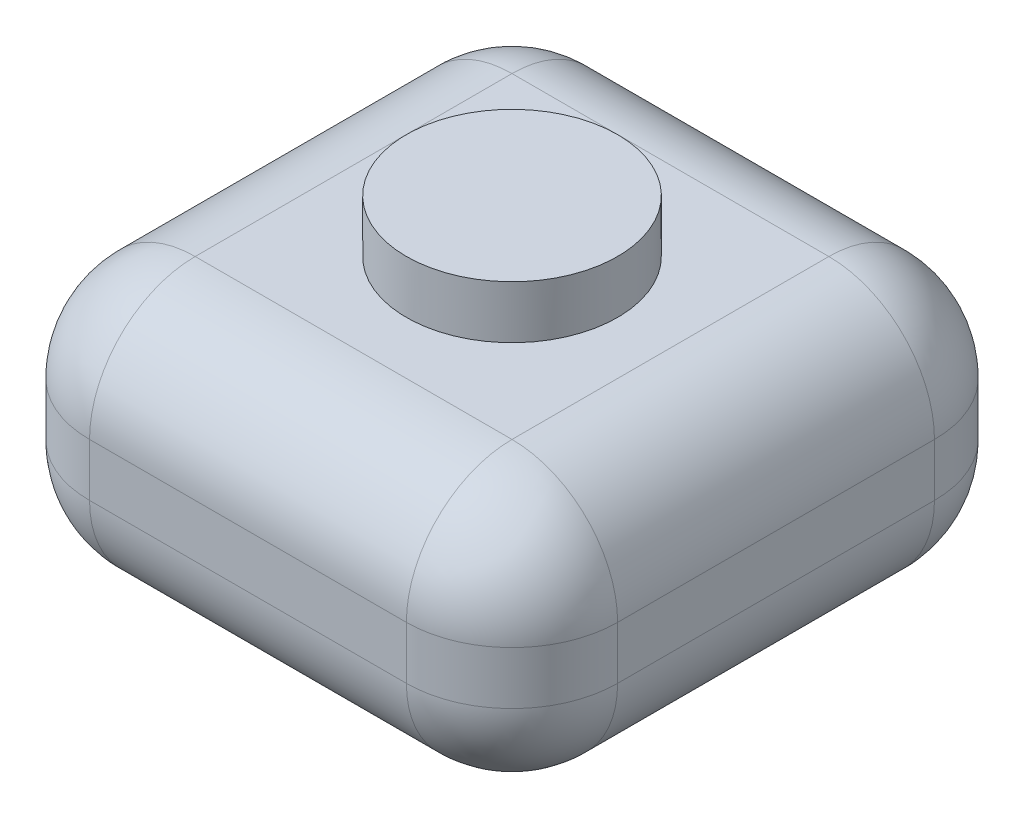
ISO-10303-21;
HEADER;
FILE_DESCRIPTION(('STEP AP214'),'2;1');
FILE_NAME('part.step','',(''),(''),'','','');
FILE_SCHEMA(('AUTOMOTIVE_DESIGN { 1 0 10303 214 1 1 1 1 }'));
ENDSEC;
DATA;
#1=APPLICATION_CONTEXT('core data for automotive mechanical design processes');
#2=APPLICATION_PROTOCOL_DEFINITION('international standard','automotive_design',2000,#1);
#3=PRODUCT_CONTEXT('',#1,'mechanical');
#4=PRODUCT('Part','Part','',(#3));
#5=PRODUCT_RELATED_PRODUCT_CATEGORY('part','',(#4));
#6=PRODUCT_DEFINITION_FORMATION('','',#4);
#7=PRODUCT_DEFINITION_CONTEXT('part definition',#1,'design');
#8=PRODUCT_DEFINITION('design','',#6,#7);
#9=PRODUCT_DEFINITION_SHAPE('','',#8);
#10=(LENGTH_UNIT() NAMED_UNIT(*) SI_UNIT(.MILLI.,.METRE.));
#11=(NAMED_UNIT(*) PLANE_ANGLE_UNIT() SI_UNIT($,.RADIAN.));
#12=(NAMED_UNIT(*) SI_UNIT($,.STERADIAN.) SOLID_ANGLE_UNIT());
#13=UNCERTAINTY_MEASURE_WITH_UNIT(LENGTH_MEASURE(1.E-05),#10,'distance_accuracy_value','');
#14=(GEOMETRIC_REPRESENTATION_CONTEXT(3) GLOBAL_UNCERTAINTY_ASSIGNED_CONTEXT((#13)) GLOBAL_UNIT_ASSIGNED_CONTEXT((#10,
#11,#12)) REPRESENTATION_CONTEXT('',''));
#15=CARTESIAN_POINT('',(0.,0.,0.));
#16=DIRECTION('',(0.,0.,1.));
#17=DIRECTION('',(1.,0.,0.));
#18=AXIS2_PLACEMENT_3D('',#15,#16,#17);
#19=CARTESIAN_POINT('',(-5.,5.,5.));
#20=DIRECTION('',(-1.,0.,0.));
#21=DIRECTION('',(0.,0.,1.));
#22=AXIS2_PLACEMENT_3D('',#19,#20,#21);
#23=PLANE('',#22);
#24=DIRECTION('',(0.,0.,-1.));
#25=VECTOR('',#24,1.);
#26=CARTESIAN_POINT('',(-5.,3.,-5.));
#27=LINE('',#26,#25);
#28=CARTESIAN_POINT('',(-5.,3.,3.));
#29=VERTEX_POINT('',#28);
#30=CARTESIAN_POINT('',(-5.,3.,-3.));
#31=VERTEX_POINT('',#30);
#32=EDGE_CURVE('E200',#29,#31,#27,.T.);
#33=ORIENTED_EDGE('',*,*,#32,.T.);
#34=DIRECTION('',(0.,-1.,0.));
#35=VECTOR('',#34,1.);
#36=CARTESIAN_POINT('',(-5.,5.,-3.));
#37=LINE('',#36,#35);
#38=CARTESIAN_POINT('',(-5.,2.,-3.));
#39=VERTEX_POINT('',#38);
#40=EDGE_CURVE('E202',#31,#39,#37,.T.);
#41=ORIENTED_EDGE('',*,*,#40,.T.);
#42=DIRECTION('',(0.,0.,-1.));
#43=VECTOR('',#42,1.);
#44=CARTESIAN_POINT('',(-5.,2.,5.));
#45=LINE('',#44,#43);
#46=CARTESIAN_POINT('',(-5.,2.,3.));
#47=VERTEX_POINT('',#46);
#48=EDGE_CURVE('E198',#39,#47,#45,.F.);
#49=ORIENTED_EDGE('',*,*,#48,.T.);
#50=DIRECTION('',(0.,-1.,0.));
#51=VECTOR('',#50,1.);
#52=CARTESIAN_POINT('',(-5.,5.,3.));
#53=LINE('',#52,#51);
#54=EDGE_CURVE('E196',#47,#29,#53,.F.);
#55=ORIENTED_EDGE('',*,*,#54,.T.);
#56=EDGE_LOOP('',(#33,#41,#49,#55));
#57=FACE_BOUND('',#56,.T.);
#58=ADVANCED_FACE('F36',(#57),#23,.T.);
#59=CARTESIAN_POINT('',(-5.,5.,5.));
#60=DIRECTION('',(0.,0.,-1.));
#61=DIRECTION('',(-1.,0.,0.));
#62=AXIS2_PLACEMENT_3D('',#59,#60,#61);
#63=PLANE('',#62);
#64=DIRECTION('',(1.,0.,0.));
#65=VECTOR('',#64,1.);
#66=CARTESIAN_POINT('',(-5.,3.,5.));
#67=LINE('',#66,#65);
#68=CARTESIAN_POINT('',(3.,3.,5.));
#69=VERTEX_POINT('',#68);
#70=CARTESIAN_POINT('',(-3.,3.,5.));
#71=VERTEX_POINT('',#70);
#72=EDGE_CURVE('E51',#69,#71,#67,.F.);
#73=ORIENTED_EDGE('',*,*,#72,.T.);
#74=DIRECTION('',(0.,-1.,0.));
#75=VECTOR('',#74,1.);
#76=CARTESIAN_POINT('',(-3.,0.,5.));
#77=LINE('',#76,#75);
#78=CARTESIAN_POINT('',(-3.,2.,5.));
#79=VERTEX_POINT('',#78);
#80=EDGE_CURVE('E44',#71,#79,#77,.T.);
#81=ORIENTED_EDGE('',*,*,#80,.T.);
#82=DIRECTION('',(1.,0.,0.));
#83=VECTOR('',#82,1.);
#84=CARTESIAN_POINT('',(5.,2.,5.));
#85=LINE('',#84,#83);
#86=CARTESIAN_POINT('',(3.,2.,5.));
#87=VERTEX_POINT('',#86);
#88=EDGE_CURVE('E205',#79,#87,#85,.T.);
#89=ORIENTED_EDGE('',*,*,#88,.T.);
#90=DIRECTION('',(0.,-1.,0.));
#91=VECTOR('',#90,1.);
#92=CARTESIAN_POINT('',(3.,5.,5.));
#93=LINE('',#92,#91);
#94=EDGE_CURVE('E56',#87,#69,#93,.F.);
#95=ORIENTED_EDGE('',*,*,#94,.T.);
#96=EDGE_LOOP('',(#73,#81,#89,#95));
#97=FACE_BOUND('',#96,.T.);
#98=ADVANCED_FACE('F298',(#97),#63,.F.);
#99=CARTESIAN_POINT('',(5.,5.,5.));
#100=DIRECTION('',(-1.,0.,0.));
#101=DIRECTION('',(0.,0.,1.));
#102=AXIS2_PLACEMENT_3D('',#99,#100,#101);
#103=PLANE('',#102);
#104=DIRECTION('',(0.,-1.,0.));
#105=VECTOR('',#104,1.);
#106=CARTESIAN_POINT('',(5.,5.,-3.));
#107=LINE('',#106,#105);
#108=CARTESIAN_POINT('',(5.,2.,-3.));
#109=VERTEX_POINT('',#108);
#110=CARTESIAN_POINT('',(5.,3.,-3.));
#111=VERTEX_POINT('',#110);
#112=EDGE_CURVE('E191',#109,#111,#107,.F.);
#113=ORIENTED_EDGE('',*,*,#112,.T.);
#114=DIRECTION('',(0.,0.,-1.));
#115=VECTOR('',#114,1.);
#116=CARTESIAN_POINT('',(5.,3.,5.));
#117=LINE('',#116,#115);
#118=CARTESIAN_POINT('',(5.,3.,3.));
#119=VERTEX_POINT('',#118);
#120=EDGE_CURVE('E193',#111,#119,#117,.F.);
#121=ORIENTED_EDGE('',*,*,#120,.T.);
#122=DIRECTION('',(0.,-1.,0.));
#123=VECTOR('',#122,1.);
#124=CARTESIAN_POINT('',(5.,5.,3.));
#125=LINE('',#124,#123);
#126=CARTESIAN_POINT('',(5.,2.,3.));
#127=VERTEX_POINT('',#126);
#128=EDGE_CURVE('E187',#119,#127,#125,.T.);
#129=ORIENTED_EDGE('',*,*,#128,.T.);
#130=DIRECTION('',(0.,0.,-1.));
#131=VECTOR('',#130,1.);
#132=CARTESIAN_POINT('',(5.,2.,-5.));
#133=LINE('',#132,#131);
#134=EDGE_CURVE('E189',#127,#109,#133,.T.);
#135=ORIENTED_EDGE('',*,*,#134,.T.);
#136=EDGE_LOOP('',(#113,#121,#129,#135));
#137=FACE_BOUND('',#136,.T.);
#138=ADVANCED_FACE('F273',(#137),#103,.F.);
#139=CARTESIAN_POINT('',(-5.,5.,-5.));
#140=DIRECTION('',(0.,0.,-1.));
#141=DIRECTION('',(-1.,0.,0.));
#142=AXIS2_PLACEMENT_3D('',#139,#140,#141);
#143=PLANE('',#142);
#144=DIRECTION('',(1.,0.,0.));
#145=VECTOR('',#144,1.);
#146=CARTESIAN_POINT('',(5.,3.,-5.));
#147=LINE('',#146,#145);
#148=CARTESIAN_POINT('',(-3.,3.,-5.));
#149=VERTEX_POINT('',#148);
#150=CARTESIAN_POINT('',(3.,3.,-5.));
#151=VERTEX_POINT('',#150);
#152=EDGE_CURVE('E135',#149,#151,#147,.T.);
#153=ORIENTED_EDGE('',*,*,#152,.T.);
#154=DIRECTION('',(0.,-1.,0.));
#155=VECTOR('',#154,1.);
#156=CARTESIAN_POINT('',(3.,0.,-5.));
#157=LINE('',#156,#155);
#158=CARTESIAN_POINT('',(3.,2.,-5.));
#159=VERTEX_POINT('',#158);
#160=EDGE_CURVE('E131',#151,#159,#157,.T.);
#161=ORIENTED_EDGE('',*,*,#160,.T.);
#162=DIRECTION('',(1.,0.,0.));
#163=VECTOR('',#162,1.);
#164=CARTESIAN_POINT('',(-5.,2.,-5.));
#165=LINE('',#164,#163);
#166=CARTESIAN_POINT('',(-3.,2.,-5.));
#167=VERTEX_POINT('',#166);
#168=EDGE_CURVE('E123',#159,#167,#165,.F.);
#169=ORIENTED_EDGE('',*,*,#168,.T.);
#170=DIRECTION('',(0.,-1.,0.));
#171=VECTOR('',#170,1.);
#172=CARTESIAN_POINT('',(-3.,5.,-5.));
#173=LINE('',#172,#171);
#174=EDGE_CURVE('E128',#167,#149,#173,.F.);
#175=ORIENTED_EDGE('',*,*,#174,.T.);
#176=EDGE_LOOP('',(#153,#161,#169,#175));
#177=FACE_BOUND('',#176,.T.);
#178=ADVANCED_FACE('F126',(#177),#143,.T.);
#179=CARTESIAN_POINT('',(0.,5.,0.));
#180=DIRECTION('',(0.,-1.,0.));
#181=DIRECTION('',(0.,0.,-1.));
#182=AXIS2_PLACEMENT_3D('',#179,#180,#181);
#183=PLANE('',#182);
#184=CARTESIAN_POINT('',(0.,5.,0.));
#185=DIRECTION('',(0.,-1.,0.));
#186=DIRECTION('',(0.,0.,-1.));
#187=AXIS2_PLACEMENT_3D('',#184,#185,#186);
#188=CIRCLE('',#187,2.);
#189=CARTESIAN_POINT('',(0.,5.,-2.));
#190=VERTEX_POINT('',#189);
#191=EDGE_CURVE('E11',#190,#190,#188,.F.);
#192=ORIENTED_EDGE('',*,*,#191,.F.);
#193=EDGE_LOOP('',(#192));
#194=FACE_BOUND('',#193,.T.);
#195=DIRECTION('',(0.,0.,-1.));
#196=VECTOR('',#195,1.);
#197=CARTESIAN_POINT('',(3.,5.,0.));
#198=LINE('',#197,#196);
#199=CARTESIAN_POINT('',(3.,5.,3.));
#200=VERTEX_POINT('',#199);
#201=CARTESIAN_POINT('',(3.,5.,-3.));
#202=VERTEX_POINT('',#201);
#203=EDGE_CURVE('E175',#200,#202,#198,.T.);
#204=ORIENTED_EDGE('',*,*,#203,.T.);
#205=DIRECTION('',(1.,0.,0.));
#206=VECTOR('',#205,1.);
#207=CARTESIAN_POINT('',(-5.,5.,-3.));
#208=LINE('',#207,#206);
#209=CARTESIAN_POINT('',(-3.,5.,-3.));
#210=VERTEX_POINT('',#209);
#211=EDGE_CURVE('E177',#202,#210,#208,.F.);
#212=ORIENTED_EDGE('',*,*,#211,.T.);
#213=DIRECTION('',(0.,0.,-1.));
#214=VECTOR('',#213,1.);
#215=CARTESIAN_POINT('',(-3.,5.,5.));
#216=LINE('',#215,#214);
#217=CARTESIAN_POINT('',(-3.,5.,3.));
#218=VERTEX_POINT('',#217);
#219=EDGE_CURVE('E173',#210,#218,#216,.F.);
#220=ORIENTED_EDGE('',*,*,#219,.T.);
#221=DIRECTION('',(1.,0.,0.));
#222=VECTOR('',#221,1.);
#223=CARTESIAN_POINT('',(0.,5.,3.));
#224=LINE('',#223,#222);
#225=EDGE_CURVE('E171',#218,#200,#224,.T.);
#226=ORIENTED_EDGE('',*,*,#225,.T.);
#227=EDGE_LOOP('',(#204,#212,#220,#226));
#228=FACE_BOUND('',#227,.T.);
#229=ADVANCED_FACE('F309',(#194,#228),#183,.F.);
#230=CARTESIAN_POINT('',(0.,0.,0.));
#231=DIRECTION('',(0.,-1.,0.));
#232=DIRECTION('',(0.,0.,-1.));
#233=AXIS2_PLACEMENT_3D('',#230,#231,#232);
#234=PLANE('',#233);
#235=DIRECTION('',(0.,0.,-1.));
#236=VECTOR('',#235,1.);
#237=CARTESIAN_POINT('',(-3.,0.,0.));
#238=LINE('',#237,#236);
#239=CARTESIAN_POINT('',(-3.,0.,3.));
#240=VERTEX_POINT('',#239);
#241=CARTESIAN_POINT('',(-3.,0.,-3.));
#242=VERTEX_POINT('',#241);
#243=EDGE_CURVE('E182',#240,#242,#238,.T.);
#244=ORIENTED_EDGE('',*,*,#243,.T.);
#245=DIRECTION('',(1.,0.,0.));
#246=VECTOR('',#245,1.);
#247=CARTESIAN_POINT('',(0.,0.,-3.));
#248=LINE('',#247,#246);
#249=CARTESIAN_POINT('',(3.,0.,-3.));
#250=VERTEX_POINT('',#249);
#251=EDGE_CURVE('E143',#242,#250,#248,.T.);
#252=ORIENTED_EDGE('',*,*,#251,.T.);
#253=DIRECTION('',(0.,0.,-1.));
#254=VECTOR('',#253,1.);
#255=CARTESIAN_POINT('',(3.,0.,5.));
#256=LINE('',#255,#254);
#257=CARTESIAN_POINT('',(3.,0.,3.));
#258=VERTEX_POINT('',#257);
#259=EDGE_CURVE('E184',#250,#258,#256,.F.);
#260=ORIENTED_EDGE('',*,*,#259,.T.);
#261=DIRECTION('',(1.,0.,0.));
#262=VECTOR('',#261,1.);
#263=CARTESIAN_POINT('',(-5.,0.,3.));
#264=LINE('',#263,#262);
#265=EDGE_CURVE('E180',#258,#240,#264,.F.);
#266=ORIENTED_EDGE('',*,*,#265,.T.);
#267=EDGE_LOOP('',(#244,#252,#260,#266));
#268=FACE_BOUND('',#267,.T.);
#269=ADVANCED_FACE('F307',(#268),#234,.T.);
#270=CARTESIAN_POINT('',(-5.,2.,3.));
#271=DIRECTION('',(-1.,0.,0.));
#272=DIRECTION('',(0.,0.,1.));
#273=AXIS2_PLACEMENT_3D('',#270,#271,#272);
#274=CYLINDRICAL_SURFACE('',#273,2.);
#275=CARTESIAN_POINT('',(-3.,2.,3.));
#276=DIRECTION('',(-1.,0.,0.));
#277=DIRECTION('',(0.,0.,1.));
#278=AXIS2_PLACEMENT_3D('',#275,#276,#277);
#279=CIRCLE('',#278,2.);
#280=EDGE_CURVE('E162',#240,#79,#279,.T.);
#281=ORIENTED_EDGE('',*,*,#280,.F.);
#282=ORIENTED_EDGE('',*,*,#265,.F.);
#283=CARTESIAN_POINT('',(3.,2.,3.));
#284=DIRECTION('',(1.,0.,0.));
#285=DIRECTION('',(0.,0.,-1.));
#286=AXIS2_PLACEMENT_3D('',#283,#284,#285);
#287=CIRCLE('',#286,2.);
#288=EDGE_CURVE('E165',#87,#258,#287,.T.);
#289=ORIENTED_EDGE('',*,*,#288,.F.);
#290=ORIENTED_EDGE('',*,*,#88,.F.);
#291=EDGE_LOOP('',(#281,#282,#289,#290));
#292=FACE_BOUND('',#291,.T.);
#293=ADVANCED_FACE('F38',(#292),#274,.T.);
#294=CARTESIAN_POINT('',(-3.,2.,3.));
#295=DIRECTION('',(0.,0.,1.));
#296=DIRECTION('',(1.,0.,0.));
#297=AXIS2_PLACEMENT_3D('',#294,#295,#296);
#298=SPHERICAL_SURFACE('',#297,2.);
#299=CARTESIAN_POINT('',(-3.,2.,3.));
#300=DIRECTION('',(0.,0.,1.));
#301=DIRECTION('',(1.,0.,0.));
#302=AXIS2_PLACEMENT_3D('',#299,#300,#301);
#303=CIRCLE('',#302,2.);
#304=EDGE_CURVE('E252',#240,#47,#303,.F.);
#305=ORIENTED_EDGE('',*,*,#304,.F.);
#306=ORIENTED_EDGE('',*,*,#280,.T.);
#307=CARTESIAN_POINT('',(-3.,2.,3.));
#308=DIRECTION('',(0.,-1.,0.));
#309=DIRECTION('',(0.,0.,-1.));
#310=AXIS2_PLACEMENT_3D('',#307,#308,#309);
#311=CIRCLE('',#310,2.);
#312=EDGE_CURVE('E255',#47,#79,#311,.F.);
#313=ORIENTED_EDGE('',*,*,#312,.F.);
#314=EDGE_LOOP('',(#305,#306,#313));
#315=FACE_BOUND('',#314,.T.);
#316=ADVANCED_FACE('F303',(#315),#298,.T.);
#317=CARTESIAN_POINT('',(3.,2.,3.));
#318=DIRECTION('',(0.,-1.,0.));
#319=DIRECTION('',(0.,0.,-1.));
#320=AXIS2_PLACEMENT_3D('',#317,#318,#319);
#321=SPHERICAL_SURFACE('',#320,2.);
#322=CARTESIAN_POINT('',(3.,2.,3.));
#323=DIRECTION('',(0.,-1.,0.));
#324=DIRECTION('',(0.,0.,-1.));
#325=AXIS2_PLACEMENT_3D('',#322,#323,#324);
#326=CIRCLE('',#325,2.);
#327=EDGE_CURVE('E246',#87,#127,#326,.F.);
#328=ORIENTED_EDGE('',*,*,#327,.F.);
#329=ORIENTED_EDGE('',*,*,#288,.T.);
#330=CARTESIAN_POINT('',(3.,2.,3.));
#331=DIRECTION('',(0.,0.,1.));
#332=DIRECTION('',(1.,0.,0.));
#333=AXIS2_PLACEMENT_3D('',#330,#331,#332);
#334=CIRCLE('',#333,2.);
#335=EDGE_CURVE('E249',#127,#258,#334,.F.);
#336=ORIENTED_EDGE('',*,*,#335,.F.);
#337=EDGE_LOOP('',(#328,#329,#336));
#338=FACE_BOUND('',#337,.T.);
#339=ADVANCED_FACE('F262',(#338),#321,.T.);
#340=CARTESIAN_POINT('',(-3.,5.,3.));
#341=DIRECTION('',(0.,1.,0.));
#342=DIRECTION('',(0.,0.,1.));
#343=AXIS2_PLACEMENT_3D('',#340,#341,#342);
#344=CYLINDRICAL_SURFACE('',#343,2.);
#345=ORIENTED_EDGE('',*,*,#312,.T.);
#346=ORIENTED_EDGE('',*,*,#80,.F.);
#347=CARTESIAN_POINT('',(-3.,3.,3.));
#348=DIRECTION('',(0.,1.,0.));
#349=DIRECTION('',(0.,0.,1.));
#350=AXIS2_PLACEMENT_3D('',#347,#348,#349);
#351=CIRCLE('',#350,2.);
#352=EDGE_CURVE('E240',#29,#71,#351,.T.);
#353=ORIENTED_EDGE('',*,*,#352,.F.);
#354=ORIENTED_EDGE('',*,*,#54,.F.);
#355=EDGE_LOOP('',(#345,#346,#353,#354));
#356=FACE_BOUND('',#355,.T.);
#357=ADVANCED_FACE('F296',(#356),#344,.T.);
#358=CARTESIAN_POINT('',(-3.,2.,0.));
#359=DIRECTION('',(0.,0.,-1.));
#360=DIRECTION('',(-1.,0.,0.));
#361=AXIS2_PLACEMENT_3D('',#358,#359,#360);
#362=CYLINDRICAL_SURFACE('',#361,2.);
#363=ORIENTED_EDGE('',*,*,#304,.T.);
#364=ORIENTED_EDGE('',*,*,#48,.F.);
#365=CARTESIAN_POINT('',(-3.,2.,-3.));
#366=DIRECTION('',(0.,0.,-1.));
#367=DIRECTION('',(-1.,0.,0.));
#368=AXIS2_PLACEMENT_3D('',#365,#366,#367);
#369=CIRCLE('',#368,2.);
#370=EDGE_CURVE('E147',#242,#39,#369,.T.);
#371=ORIENTED_EDGE('',*,*,#370,.F.);
#372=ORIENTED_EDGE('',*,*,#243,.F.);
#373=EDGE_LOOP('',(#363,#364,#371,#372));
#374=FACE_BOUND('',#373,.T.);
#375=ADVANCED_FACE('F305',(#374),#362,.T.);
#376=CARTESIAN_POINT('',(0.,2.,-3.));
#377=DIRECTION('',(1.,0.,0.));
#378=DIRECTION('',(0.,0.,-1.));
#379=AXIS2_PLACEMENT_3D('',#376,#377,#378);
#380=CYLINDRICAL_SURFACE('',#379,2.);
#381=CARTESIAN_POINT('',(3.,2.,-3.));
#382=DIRECTION('',(1.,0.,0.));
#383=DIRECTION('',(0.,0.,-1.));
#384=AXIS2_PLACEMENT_3D('',#381,#382,#383);
#385=CIRCLE('',#384,2.);
#386=EDGE_CURVE('E148',#250,#159,#385,.T.);
#387=ORIENTED_EDGE('',*,*,#386,.F.);
#388=ORIENTED_EDGE('',*,*,#251,.F.);
#389=CARTESIAN_POINT('',(-3.,2.,-3.));
#390=DIRECTION('',(-1.,0.,0.));
#391=DIRECTION('',(0.,0.,1.));
#392=AXIS2_PLACEMENT_3D('',#389,#390,#391);
#393=CIRCLE('',#392,2.);
#394=EDGE_CURVE('E139',#167,#242,#393,.T.);
#395=ORIENTED_EDGE('',*,*,#394,.F.);
#396=ORIENTED_EDGE('',*,*,#168,.F.);
#397=EDGE_LOOP('',(#387,#388,#395,#396));
#398=FACE_BOUND('',#397,.T.);
#399=ADVANCED_FACE('F141',(#398),#380,.T.);
#400=CARTESIAN_POINT('',(3.,2.,5.));
#401=DIRECTION('',(0.,0.,1.));
#402=DIRECTION('',(1.,0.,0.));
#403=AXIS2_PLACEMENT_3D('',#400,#401,#402);
#404=CYLINDRICAL_SURFACE('',#403,2.);
#405=ORIENTED_EDGE('',*,*,#335,.T.);
#406=ORIENTED_EDGE('',*,*,#259,.F.);
#407=CARTESIAN_POINT('',(3.,2.,-3.));
#408=DIRECTION('',(0.,0.,-1.));
#409=DIRECTION('',(-1.,0.,0.));
#410=AXIS2_PLACEMENT_3D('',#407,#408,#409);
#411=CIRCLE('',#410,2.);
#412=EDGE_CURVE('E236',#109,#250,#411,.T.);
#413=ORIENTED_EDGE('',*,*,#412,.F.);
#414=ORIENTED_EDGE('',*,*,#134,.F.);
#415=EDGE_LOOP('',(#405,#406,#413,#414));
#416=FACE_BOUND('',#415,.T.);
#417=ADVANCED_FACE('F269',(#416),#404,.T.);
#418=CARTESIAN_POINT('',(3.,5.,3.));
#419=DIRECTION('',(0.,-1.,0.));
#420=DIRECTION('',(0.,0.,-1.));
#421=AXIS2_PLACEMENT_3D('',#418,#419,#420);
#422=CYLINDRICAL_SURFACE('',#421,2.);
#423=ORIENTED_EDGE('',*,*,#327,.T.);
#424=ORIENTED_EDGE('',*,*,#128,.F.);
#425=CARTESIAN_POINT('',(3.,3.,3.));
#426=DIRECTION('',(0.,1.,0.));
#427=DIRECTION('',(0.,0.,1.));
#428=AXIS2_PLACEMENT_3D('',#425,#426,#427);
#429=CIRCLE('',#428,2.);
#430=EDGE_CURVE('E233',#69,#119,#429,.T.);
#431=ORIENTED_EDGE('',*,*,#430,.F.);
#432=ORIENTED_EDGE('',*,*,#94,.F.);
#433=EDGE_LOOP('',(#423,#424,#431,#432));
#434=FACE_BOUND('',#433,.T.);
#435=ADVANCED_FACE('F279',(#434),#422,.T.);
#436=CARTESIAN_POINT('',(0.,3.,3.));
#437=DIRECTION('',(1.,0.,0.));
#438=DIRECTION('',(0.,0.,-1.));
#439=AXIS2_PLACEMENT_3D('',#436,#437,#438);
#440=CYLINDRICAL_SURFACE('',#439,2.);
#441=CARTESIAN_POINT('',(-3.,3.,3.));
#442=DIRECTION('',(-1.,0.,0.));
#443=DIRECTION('',(0.,0.,1.));
#444=AXIS2_PLACEMENT_3D('',#441,#442,#443);
#445=CIRCLE('',#444,2.);
#446=EDGE_CURVE('E243',#71,#218,#445,.T.);
#447=ORIENTED_EDGE('',*,*,#446,.F.);
#448=ORIENTED_EDGE('',*,*,#72,.F.);
#449=CARTESIAN_POINT('',(3.,3.,3.));
#450=DIRECTION('',(1.,0.,0.));
#451=DIRECTION('',(0.,0.,-1.));
#452=AXIS2_PLACEMENT_3D('',#449,#450,#451);
#453=CIRCLE('',#452,2.);
#454=EDGE_CURVE('E230',#200,#69,#453,.T.);
#455=ORIENTED_EDGE('',*,*,#454,.F.);
#456=ORIENTED_EDGE('',*,*,#225,.F.);
#457=EDGE_LOOP('',(#447,#448,#455,#456));
#458=FACE_BOUND('',#457,.T.);
#459=ADVANCED_FACE('F288',(#458),#440,.T.);
#460=CARTESIAN_POINT('',(-3.,3.,3.));
#461=DIRECTION('',(0.,0.,1.));
#462=DIRECTION('',(1.,0.,0.));
#463=AXIS2_PLACEMENT_3D('',#460,#461,#462);
#464=SPHERICAL_SURFACE('',#463,2.);
#465=ORIENTED_EDGE('',*,*,#352,.T.);
#466=ORIENTED_EDGE('',*,*,#446,.T.);
#467=CARTESIAN_POINT('',(-3.,3.,3.));
#468=DIRECTION('',(0.,0.,1.));
#469=DIRECTION('',(1.,0.,0.));
#470=AXIS2_PLACEMENT_3D('',#467,#468,#469);
#471=CIRCLE('',#470,2.);
#472=EDGE_CURVE('E155',#29,#218,#471,.F.);
#473=ORIENTED_EDGE('',*,*,#472,.F.);
#474=EDGE_LOOP('',(#465,#466,#473));
#475=FACE_BOUND('',#474,.T.);
#476=ADVANCED_FACE('F292',(#475),#464,.T.);
#477=CARTESIAN_POINT('',(-3.,2.,-3.));
#478=DIRECTION('',(0.,-1.,0.));
#479=DIRECTION('',(0.,0.,-1.));
#480=AXIS2_PLACEMENT_3D('',#477,#478,#479);
#481=SPHERICAL_SURFACE('',#480,2.);
#482=ORIENTED_EDGE('',*,*,#394,.T.);
#483=ORIENTED_EDGE('',*,*,#370,.T.);
#484=CARTESIAN_POINT('',(-3.,2.,-3.));
#485=DIRECTION('',(0.,-1.,0.));
#486=DIRECTION('',(0.,0.,-1.));
#487=AXIS2_PLACEMENT_3D('',#484,#485,#486);
#488=CIRCLE('',#487,2.);
#489=EDGE_CURVE('E150',#167,#39,#488,.F.);
#490=ORIENTED_EDGE('',*,*,#489,.F.);
#491=EDGE_LOOP('',(#482,#483,#490));
#492=FACE_BOUND('',#491,.T.);
#493=ADVANCED_FACE('F151',(#492),#481,.T.);
#494=CARTESIAN_POINT('',(3.,2.,-3.));
#495=DIRECTION('',(0.,-1.,0.));
#496=DIRECTION('',(0.,0.,-1.));
#497=AXIS2_PLACEMENT_3D('',#494,#495,#496);
#498=SPHERICAL_SURFACE('',#497,2.);
#499=ORIENTED_EDGE('',*,*,#412,.T.);
#500=ORIENTED_EDGE('',*,*,#386,.T.);
#501=CARTESIAN_POINT('',(3.,2.,-3.));
#502=DIRECTION('',(0.,-1.,0.));
#503=DIRECTION('',(0.,0.,-1.));
#504=AXIS2_PLACEMENT_3D('',#501,#502,#503);
#505=CIRCLE('',#504,2.);
#506=EDGE_CURVE('E156',#109,#159,#505,.F.);
#507=ORIENTED_EDGE('',*,*,#506,.F.);
#508=EDGE_LOOP('',(#499,#500,#507));
#509=FACE_BOUND('',#508,.T.);
#510=ADVANCED_FACE('F356',(#509),#498,.T.);
#511=CARTESIAN_POINT('',(3.,3.,3.));
#512=DIRECTION('',(0.,0.,1.));
#513=DIRECTION('',(1.,0.,0.));
#514=AXIS2_PLACEMENT_3D('',#511,#512,#513);
#515=SPHERICAL_SURFACE('',#514,2.);
#516=ORIENTED_EDGE('',*,*,#454,.T.);
#517=ORIENTED_EDGE('',*,*,#430,.T.);
#518=CARTESIAN_POINT('',(3.,3.,3.));
#519=DIRECTION('',(0.,0.,1.));
#520=DIRECTION('',(1.,0.,0.));
#521=AXIS2_PLACEMENT_3D('',#518,#519,#520);
#522=CIRCLE('',#521,2.);
#523=EDGE_CURVE('E224',#200,#119,#522,.F.);
#524=ORIENTED_EDGE('',*,*,#523,.F.);
#525=EDGE_LOOP('',(#516,#517,#524));
#526=FACE_BOUND('',#525,.T.);
#527=ADVANCED_FACE('F283',(#526),#515,.T.);
#528=CARTESIAN_POINT('',(-3.,3.,5.));
#529=DIRECTION('',(0.,0.,1.));
#530=DIRECTION('',(1.,0.,0.));
#531=AXIS2_PLACEMENT_3D('',#528,#529,#530);
#532=CYLINDRICAL_SURFACE('',#531,2.);
#533=ORIENTED_EDGE('',*,*,#472,.T.);
#534=ORIENTED_EDGE('',*,*,#219,.F.);
#535=CARTESIAN_POINT('',(-3.,3.,-3.));
#536=DIRECTION('',(0.,0.,-1.));
#537=DIRECTION('',(-1.,0.,0.));
#538=AXIS2_PLACEMENT_3D('',#535,#536,#537);
#539=CIRCLE('',#538,2.);
#540=EDGE_CURVE('E221',#31,#210,#539,.T.);
#541=ORIENTED_EDGE('',*,*,#540,.F.);
#542=ORIENTED_EDGE('',*,*,#32,.F.);
#543=EDGE_LOOP('',(#533,#534,#541,#542));
#544=FACE_BOUND('',#543,.T.);
#545=ADVANCED_FACE('F350',(#544),#532,.T.);
#546=CARTESIAN_POINT('',(-3.,5.,-3.));
#547=DIRECTION('',(0.,-1.,0.));
#548=DIRECTION('',(0.,0.,-1.));
#549=AXIS2_PLACEMENT_3D('',#546,#547,#548);
#550=CYLINDRICAL_SURFACE('',#549,2.);
#551=ORIENTED_EDGE('',*,*,#489,.T.);
#552=ORIENTED_EDGE('',*,*,#40,.F.);
#553=CARTESIAN_POINT('',(-3.,3.,-3.));
#554=DIRECTION('',(0.,1.,0.));
#555=DIRECTION('',(0.,0.,1.));
#556=AXIS2_PLACEMENT_3D('',#553,#554,#555);
#557=CIRCLE('',#556,2.);
#558=EDGE_CURVE('E160',#149,#31,#557,.T.);
#559=ORIENTED_EDGE('',*,*,#558,.F.);
#560=ORIENTED_EDGE('',*,*,#174,.F.);
#561=EDGE_LOOP('',(#551,#552,#559,#560));
#562=FACE_BOUND('',#561,.T.);
#563=ADVANCED_FACE('F158',(#562),#550,.T.);
#564=CARTESIAN_POINT('',(3.,5.,-3.));
#565=DIRECTION('',(0.,1.,0.));
#566=DIRECTION('',(0.,0.,1.));
#567=AXIS2_PLACEMENT_3D('',#564,#565,#566);
#568=CYLINDRICAL_SURFACE('',#567,2.);
#569=ORIENTED_EDGE('',*,*,#506,.T.);
#570=ORIENTED_EDGE('',*,*,#160,.F.);
#571=CARTESIAN_POINT('',(3.,3.,-3.));
#572=DIRECTION('',(0.,1.,0.));
#573=DIRECTION('',(0.,0.,1.));
#574=AXIS2_PLACEMENT_3D('',#571,#572,#573);
#575=CIRCLE('',#574,2.);
#576=EDGE_CURVE('E217',#111,#151,#575,.T.);
#577=ORIENTED_EDGE('',*,*,#576,.F.);
#578=ORIENTED_EDGE('',*,*,#112,.F.);
#579=EDGE_LOOP('',(#569,#570,#577,#578));
#580=FACE_BOUND('',#579,.T.);
#581=ADVANCED_FACE('F343',(#580),#568,.T.);
#582=CARTESIAN_POINT('',(3.,3.,0.));
#583=DIRECTION('',(0.,0.,-1.));
#584=DIRECTION('',(-1.,0.,0.));
#585=AXIS2_PLACEMENT_3D('',#582,#583,#584);
#586=CYLINDRICAL_SURFACE('',#585,2.);
#587=ORIENTED_EDGE('',*,*,#523,.T.);
#588=ORIENTED_EDGE('',*,*,#120,.F.);
#589=CARTESIAN_POINT('',(3.,3.,-3.));
#590=DIRECTION('',(0.,0.,-1.));
#591=DIRECTION('',(-1.,0.,0.));
#592=AXIS2_PLACEMENT_3D('',#589,#590,#591);
#593=CIRCLE('',#592,2.);
#594=EDGE_CURVE('E214',#202,#111,#593,.T.);
#595=ORIENTED_EDGE('',*,*,#594,.F.);
#596=ORIENTED_EDGE('',*,*,#203,.F.);
#597=EDGE_LOOP('',(#587,#588,#595,#596));
#598=FACE_BOUND('',#597,.T.);
#599=ADVANCED_FACE('F339',(#598),#586,.T.);
#600=CARTESIAN_POINT('',(-3.,3.,-3.));
#601=DIRECTION('',(-1.,0.,0.));
#602=DIRECTION('',(0.,0.,1.));
#603=AXIS2_PLACEMENT_3D('',#600,#601,#602);
#604=SPHERICAL_SURFACE('',#603,2.);
#605=ORIENTED_EDGE('',*,*,#558,.T.);
#606=ORIENTED_EDGE('',*,*,#540,.T.);
#607=CARTESIAN_POINT('',(-3.,3.,-3.));
#608=DIRECTION('',(-1.,0.,0.));
#609=DIRECTION('',(0.,0.,1.));
#610=AXIS2_PLACEMENT_3D('',#607,#608,#609);
#611=CIRCLE('',#610,2.);
#612=EDGE_CURVE('E212',#149,#210,#611,.F.);
#613=ORIENTED_EDGE('',*,*,#612,.F.);
#614=EDGE_LOOP('',(#605,#606,#613));
#615=FACE_BOUND('',#614,.T.);
#616=ADVANCED_FACE('F335',(#615),#604,.T.);
#617=CARTESIAN_POINT('',(3.,3.,-3.));
#618=DIRECTION('',(1.,0.,0.));
#619=DIRECTION('',(0.,0.,-1.));
#620=AXIS2_PLACEMENT_3D('',#617,#618,#619);
#621=SPHERICAL_SURFACE('',#620,2.);
#622=ORIENTED_EDGE('',*,*,#594,.T.);
#623=ORIENTED_EDGE('',*,*,#576,.T.);
#624=CARTESIAN_POINT('',(3.,3.,-3.));
#625=DIRECTION('',(1.,0.,0.));
#626=DIRECTION('',(0.,0.,-1.));
#627=AXIS2_PLACEMENT_3D('',#624,#625,#626);
#628=CIRCLE('',#627,2.);
#629=EDGE_CURVE('E210',#202,#151,#628,.F.);
#630=ORIENTED_EDGE('',*,*,#629,.F.);
#631=EDGE_LOOP('',(#622,#623,#630));
#632=FACE_BOUND('',#631,.T.);
#633=ADVANCED_FACE('F331',(#632),#621,.T.);
#634=CARTESIAN_POINT('',(-5.,3.,-3.));
#635=DIRECTION('',(-1.,0.,0.));
#636=DIRECTION('',(0.,0.,1.));
#637=AXIS2_PLACEMENT_3D('',#634,#635,#636);
#638=CYLINDRICAL_SURFACE('',#637,2.);
#639=ORIENTED_EDGE('',*,*,#612,.T.);
#640=ORIENTED_EDGE('',*,*,#211,.F.);
#641=ORIENTED_EDGE('',*,*,#629,.T.);
#642=ORIENTED_EDGE('',*,*,#152,.F.);
#643=EDGE_LOOP('',(#639,#640,#641,#642));
#644=FACE_BOUND('',#643,.T.);
#645=ADVANCED_FACE('F327',(#644),#638,.T.);
#646=CARTESIAN_POINT('',(0.,6.,0.));
#647=DIRECTION('',(0.,-1.,0.));
#648=DIRECTION('',(0.,0.,-1.));
#649=AXIS2_PLACEMENT_3D('',#646,#647,#648);
#650=CYLINDRICAL_SURFACE('',#649,2.);
#651=CARTESIAN_POINT('',(0.,6.,0.));
#652=DIRECTION('',(0.,1.,0.));
#653=DIRECTION('',(0.,0.,1.));
#654=AXIS2_PLACEMENT_3D('',#651,#652,#653);
#655=CIRCLE('',#654,2.);
#656=CARTESIAN_POINT('',(0.,6.,2.));
#657=VERTEX_POINT('',#656);
#658=EDGE_CURVE('E167',#657,#657,#655,.T.);
#659=ORIENTED_EDGE('',*,*,#658,.F.);
#660=EDGE_LOOP('',(#659));
#661=FACE_BOUND('',#660,.T.);
#662=ORIENTED_EDGE('',*,*,#191,.T.);
#663=EDGE_LOOP('',(#662));
#664=FACE_BOUND('',#663,.T.);
#665=ADVANCED_FACE('F330',(#661,#664),#650,.T.);
#666=CARTESIAN_POINT('',(0.,6.,0.));
#667=DIRECTION('',(0.,1.,0.));
#668=DIRECTION('',(0.,0.,1.));
#669=AXIS2_PLACEMENT_3D('',#666,#667,#668);
#670=PLANE('',#669);
#671=ORIENTED_EDGE('',*,*,#658,.T.);
#672=EDGE_LOOP('',(#671));
#673=FACE_BOUND('',#672,.T.);
#674=ADVANCED_FACE('F461',(#673),#670,.T.);
#675=CLOSED_SHELL('',(#58,#98,#138,#178,#229,#269,#293,#316,#339,#357,#375,#399,#417,#435,#459,
#476,#493,#510,#527,#545,#563,#581,#599,#616,#633,#645,#665,#674));
#676=MANIFOLD_SOLID_BREP('B2',#675);
#677=ADVANCED_BREP_SHAPE_REPRESENTATION('',(#18,#676),#14);
#678=SHAPE_DEFINITION_REPRESENTATION(#9,#677);
ENDSEC;
END-ISO-10303-21;
